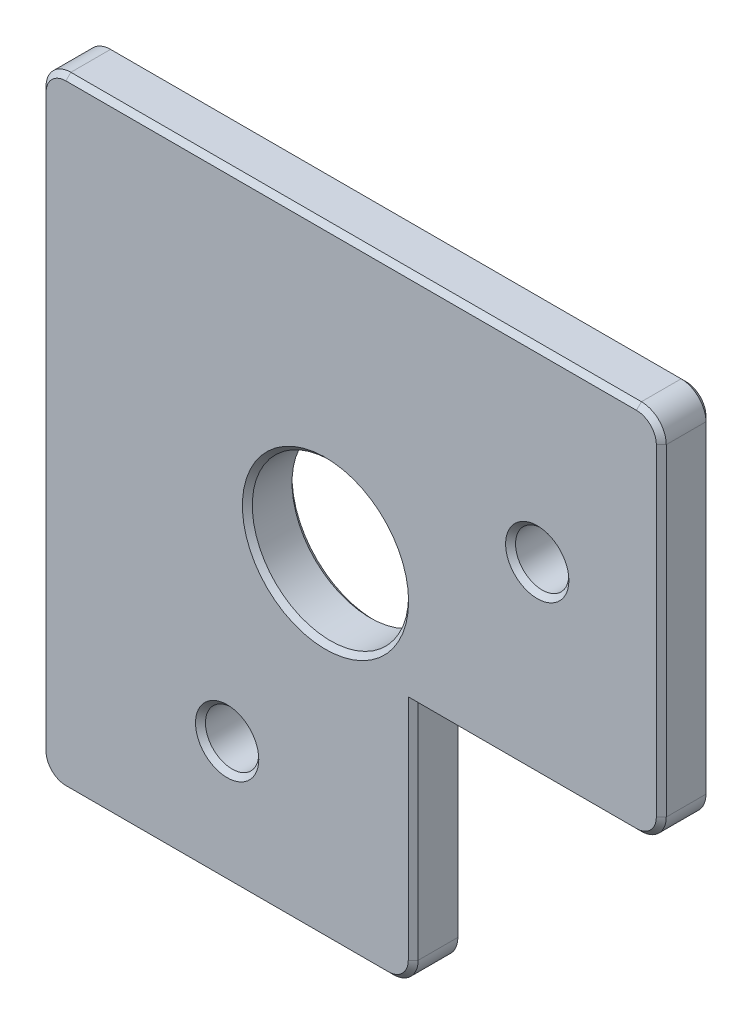
ISO-10303-21;
HEADER;
FILE_DESCRIPTION(('STEP AP214'),'2;1');
FILE_NAME('part.step','',(''),(''),'','','');
FILE_SCHEMA(('AUTOMOTIVE_DESIGN { 1 0 10303 214 1 1 1 1 }'));
ENDSEC;
DATA;
#1=APPLICATION_CONTEXT('core data for automotive mechanical design processes');
#2=APPLICATION_PROTOCOL_DEFINITION('international standard','automotive_design',2000,#1);
#3=PRODUCT_CONTEXT('',#1,'mechanical');
#4=PRODUCT('Part','Part','',(#3));
#5=PRODUCT_RELATED_PRODUCT_CATEGORY('part','',(#4));
#6=PRODUCT_DEFINITION_FORMATION('','',#4);
#7=PRODUCT_DEFINITION_CONTEXT('part definition',#1,'design');
#8=PRODUCT_DEFINITION('design','',#6,#7);
#9=PRODUCT_DEFINITION_SHAPE('','',#8);
#10=(LENGTH_UNIT() NAMED_UNIT(*) SI_UNIT(.MILLI.,.METRE.));
#11=(NAMED_UNIT(*) PLANE_ANGLE_UNIT() SI_UNIT($,.RADIAN.));
#12=(NAMED_UNIT(*) SI_UNIT($,.STERADIAN.) SOLID_ANGLE_UNIT());
#13=UNCERTAINTY_MEASURE_WITH_UNIT(LENGTH_MEASURE(1.E-05),#10,'distance_accuracy_value','');
#14=(GEOMETRIC_REPRESENTATION_CONTEXT(3) GLOBAL_UNCERTAINTY_ASSIGNED_CONTEXT((#13)) GLOBAL_UNIT_ASSIGNED_CONTEXT((#10,
#11,#12)) REPRESENTATION_CONTEXT('',''));
#15=CARTESIAN_POINT('',(0.,0.,0.));
#16=DIRECTION('',(0.,0.,1.));
#17=DIRECTION('',(1.,0.,0.));
#18=AXIS2_PLACEMENT_3D('',#15,#16,#17);
#19=CARTESIAN_POINT('',(0.,0.,4.));
#20=DIRECTION('',(0.,0.,1.));
#21=DIRECTION('',(1.,0.,0.));
#22=AXIS2_PLACEMENT_3D('',#19,#20,#21);
#23=PLANE('',#22);
#24=CARTESIAN_POINT('',(22.9289321881348,-22.9289321881346,4.));
#25=DIRECTION('',(0.,0.,1.));
#26=DIRECTION('',(1.,0.,0.));
#27=AXIS2_PLACEMENT_3D('',#24,#25,#26);
#28=CIRCLE('',#27,6.70000000000001);
#29=CARTESIAN_POINT('',(29.6289321881348,-22.9289321881346,4.));
#30=VERTEX_POINT('',#29);
#31=EDGE_CURVE('E228',#30,#30,#28,.F.);
#32=ORIENTED_EDGE('',*,*,#31,.T.);
#33=EDGE_LOOP('',(#32));
#34=FACE_BOUND('',#33,.T.);
#35=CARTESIAN_POINT('',(15.0000000000002,-40.,4.));
#36=DIRECTION('',(0.,0.,1.));
#37=DIRECTION('',(1.,0.,0.));
#38=AXIS2_PLACEMENT_3D('',#35,#36,#37);
#39=CIRCLE('',#38,2.54999999999998);
#40=CARTESIAN_POINT('',(17.5500000000002,-40.,4.));
#41=VERTEX_POINT('',#40);
#42=EDGE_CURVE('E223',#41,#41,#39,.F.);
#43=ORIENTED_EDGE('',*,*,#42,.T.);
#44=EDGE_LOOP('',(#43));
#45=FACE_BOUND('',#44,.T.);
#46=DIRECTION('',(0.,1.,0.));
#47=VECTOR('',#46,1.);
#48=CARTESIAN_POINT('',(49.6000000000003,-2.,4.));
#49=LINE('',#48,#47);
#50=CARTESIAN_POINT('',(49.6000000000003,-28.,4.));
#51=VERTEX_POINT('',#50);
#52=CARTESIAN_POINT('',(49.6000000000003,-2.,4.));
#53=VERTEX_POINT('',#52);
#54=EDGE_CURVE('E220',#51,#53,#49,.T.);
#55=ORIENTED_EDGE('',*,*,#54,.T.);
#56=CARTESIAN_POINT('',(48.0000000000003,-2.,4.));
#57=DIRECTION('',(0.,0.,1.));
#58=DIRECTION('',(1.,0.,0.));
#59=AXIS2_PLACEMENT_3D('',#56,#57,#58);
#60=CIRCLE('',#59,1.6);
#61=CARTESIAN_POINT('',(48.0000000000003,-0.399999999999998,4.));
#62=VERTEX_POINT('',#61);
#63=EDGE_CURVE('E199',#53,#62,#60,.T.);
#64=ORIENTED_EDGE('',*,*,#63,.T.);
#65=DIRECTION('',(-1.,0.,0.));
#66=VECTOR('',#65,1.);
#67=CARTESIAN_POINT('',(2.,-0.399999999999998,4.));
#68=LINE('',#67,#66);
#69=CARTESIAN_POINT('',(2.,-0.399999999999998,4.));
#70=VERTEX_POINT('',#69);
#71=EDGE_CURVE('E208',#62,#70,#68,.T.);
#72=ORIENTED_EDGE('',*,*,#71,.T.);
#73=CARTESIAN_POINT('',(2.,-2.,4.));
#74=DIRECTION('',(0.,0.,1.));
#75=DIRECTION('',(1.,0.,0.));
#76=AXIS2_PLACEMENT_3D('',#73,#74,#75);
#77=CIRCLE('',#76,1.6);
#78=CARTESIAN_POINT('',(0.399999999999998,-2.,4.));
#79=VERTEX_POINT('',#78);
#80=EDGE_CURVE('E215',#70,#79,#77,.T.);
#81=ORIENTED_EDGE('',*,*,#80,.T.);
#82=DIRECTION('',(0.,-1.,0.));
#83=VECTOR('',#82,1.);
#84=CARTESIAN_POINT('',(0.399999999999998,-48.,4.));
#85=LINE('',#84,#83);
#86=CARTESIAN_POINT('',(0.399999999999998,-48.,4.));
#87=VERTEX_POINT('',#86);
#88=EDGE_CURVE('E515',#79,#87,#85,.T.);
#89=ORIENTED_EDGE('',*,*,#88,.T.);
#90=CARTESIAN_POINT('',(2.,-48.,4.));
#91=DIRECTION('',(0.,0.,1.));
#92=DIRECTION('',(1.,0.,0.));
#93=AXIS2_PLACEMENT_3D('',#90,#91,#92);
#94=CIRCLE('',#93,1.6);
#95=CARTESIAN_POINT('',(2.,-49.6,4.));
#96=VERTEX_POINT('',#95);
#97=EDGE_CURVE('E518',#87,#96,#94,.T.);
#98=ORIENTED_EDGE('',*,*,#97,.T.);
#99=DIRECTION('',(1.,0.,0.));
#100=VECTOR('',#99,1.);
#101=CARTESIAN_POINT('',(28.0000000000003,-49.6,4.));
#102=LINE('',#101,#100);
#103=CARTESIAN_POINT('',(28.0000000000003,-49.6,4.));
#104=VERTEX_POINT('',#103);
#105=EDGE_CURVE('E521',#96,#104,#102,.T.);
#106=ORIENTED_EDGE('',*,*,#105,.T.);
#107=CARTESIAN_POINT('',(28.0000000000003,-48.,4.));
#108=DIRECTION('',(0.,0.,1.));
#109=DIRECTION('',(1.,0.,0.));
#110=AXIS2_PLACEMENT_3D('',#107,#108,#109);
#111=CIRCLE('',#110,1.6);
#112=CARTESIAN_POINT('',(29.6000000000003,-48.,4.));
#113=VERTEX_POINT('',#112);
#114=EDGE_CURVE('E524',#104,#113,#111,.T.);
#115=ORIENTED_EDGE('',*,*,#114,.T.);
#116=DIRECTION('',(0.,1.,0.));
#117=VECTOR('',#116,1.);
#118=CARTESIAN_POINT('',(29.6000000000003,-30.,4.));
#119=LINE('',#118,#117);
#120=CARTESIAN_POINT('',(29.6000000000003,-29.6,4.));
#121=VERTEX_POINT('',#120);
#122=EDGE_CURVE('E527',#113,#121,#119,.T.);
#123=ORIENTED_EDGE('',*,*,#122,.T.);
#124=DIRECTION('',(1.,0.,0.));
#125=VECTOR('',#124,1.);
#126=CARTESIAN_POINT('',(48.0000000000003,-29.6,4.));
#127=LINE('',#126,#125);
#128=CARTESIAN_POINT('',(48.0000000000003,-29.6,4.));
#129=VERTEX_POINT('',#128);
#130=EDGE_CURVE('E530',#121,#129,#127,.T.);
#131=ORIENTED_EDGE('',*,*,#130,.T.);
#132=CARTESIAN_POINT('',(48.0000000000003,-28.,4.));
#133=DIRECTION('',(0.,0.,1.));
#134=DIRECTION('',(1.,0.,0.));
#135=AXIS2_PLACEMENT_3D('',#132,#133,#134);
#136=CIRCLE('',#135,1.6);
#137=EDGE_CURVE('E230',#129,#51,#136,.T.);
#138=ORIENTED_EDGE('',*,*,#137,.T.);
#139=EDGE_LOOP('',(#55,#64,#72,#81,#89,#98,#106,#115,#123,#131,#138));
#140=FACE_BOUND('',#139,.T.);
#141=CARTESIAN_POINT('',(40.0000000000003,-15.,4.));
#142=DIRECTION('',(0.,0.,1.));
#143=DIRECTION('',(1.,0.,0.));
#144=AXIS2_PLACEMENT_3D('',#141,#142,#143);
#145=CIRCLE('',#144,2.55);
#146=CARTESIAN_POINT('',(42.5500000000003,-15.,4.));
#147=VERTEX_POINT('',#146);
#148=EDGE_CURVE('E216',#147,#147,#145,.F.);
#149=ORIENTED_EDGE('',*,*,#148,.T.);
#150=EDGE_LOOP('',(#149));
#151=FACE_BOUND('',#150,.T.);
#152=ADVANCED_FACE('F41',(#34,#45,#140,#151),#23,.T.);
#153=CARTESIAN_POINT('',(0.,0.,0.));
#154=DIRECTION('',(0.,0.,1.));
#155=DIRECTION('',(1.,0.,0.));
#156=AXIS2_PLACEMENT_3D('',#153,#154,#155);
#157=PLANE('',#156);
#158=CARTESIAN_POINT('',(22.9289321881348,-22.9289321881346,0.));
#159=DIRECTION('',(0.,0.,1.));
#160=DIRECTION('',(1.,0.,0.));
#161=AXIS2_PLACEMENT_3D('',#158,#159,#160);
#162=CIRCLE('',#161,6.70000000000001);
#163=CARTESIAN_POINT('',(29.6289321881348,-22.9289321881346,0.));
#164=VERTEX_POINT('',#163);
#165=EDGE_CURVE('E11',#164,#164,#162,.T.);
#166=ORIENTED_EDGE('',*,*,#165,.T.);
#167=EDGE_LOOP('',(#166));
#168=FACE_BOUND('',#167,.T.);
#169=CARTESIAN_POINT('',(40.0000000000003,-15.,0.));
#170=DIRECTION('',(0.,0.,1.));
#171=DIRECTION('',(1.,0.,0.));
#172=AXIS2_PLACEMENT_3D('',#169,#170,#171);
#173=CIRCLE('',#172,2.55);
#174=CARTESIAN_POINT('',(42.5500000000003,-15.,0.));
#175=VERTEX_POINT('',#174);
#176=EDGE_CURVE('E52',#175,#175,#173,.T.);
#177=ORIENTED_EDGE('',*,*,#176,.T.);
#178=EDGE_LOOP('',(#177));
#179=FACE_BOUND('',#178,.T.);
#180=CARTESIAN_POINT('',(15.0000000000002,-40.,0.));
#181=DIRECTION('',(0.,0.,1.));
#182=DIRECTION('',(1.,0.,0.));
#183=AXIS2_PLACEMENT_3D('',#180,#181,#182);
#184=CIRCLE('',#183,2.55);
#185=CARTESIAN_POINT('',(17.5500000000002,-40.,0.));
#186=VERTEX_POINT('',#185);
#187=EDGE_CURVE('E350',#186,#186,#184,.T.);
#188=ORIENTED_EDGE('',*,*,#187,.T.);
#189=EDGE_LOOP('',(#188));
#190=FACE_BOUND('',#189,.T.);
#191=DIRECTION('',(-1.,0.,0.));
#192=VECTOR('',#191,1.);
#193=CARTESIAN_POINT('',(0.,-49.6,0.));
#194=LINE('',#193,#192);
#195=CARTESIAN_POINT('',(28.0000000000003,-49.6,0.));
#196=VERTEX_POINT('',#195);
#197=CARTESIAN_POINT('',(2.,-49.6,0.));
#198=VERTEX_POINT('',#197);
#199=EDGE_CURVE('E60',#196,#198,#194,.T.);
#200=ORIENTED_EDGE('',*,*,#199,.T.);
#201=CARTESIAN_POINT('',(2.,-48.,0.));
#202=DIRECTION('',(0.,0.,1.));
#203=DIRECTION('',(1.,0.,0.));
#204=AXIS2_PLACEMENT_3D('',#201,#202,#203);
#205=CIRCLE('',#204,1.6);
#206=CARTESIAN_POINT('',(0.399999999999998,-48.,0.));
#207=VERTEX_POINT('',#206);
#208=EDGE_CURVE('E347',#198,#207,#205,.F.);
#209=ORIENTED_EDGE('',*,*,#208,.T.);
#210=DIRECTION('',(0.,1.,0.));
#211=VECTOR('',#210,1.);
#212=CARTESIAN_POINT('',(0.399999999999998,0.,0.));
#213=LINE('',#212,#211);
#214=CARTESIAN_POINT('',(0.399999999999998,-2.,0.));
#215=VERTEX_POINT('',#214);
#216=EDGE_CURVE('E319',#207,#215,#213,.T.);
#217=ORIENTED_EDGE('',*,*,#216,.T.);
#218=CARTESIAN_POINT('',(2.,-2.,0.));
#219=DIRECTION('',(0.,0.,1.));
#220=DIRECTION('',(1.,0.,0.));
#221=AXIS2_PLACEMENT_3D('',#218,#219,#220);
#222=CIRCLE('',#221,1.6);
#223=CARTESIAN_POINT('',(2.,-0.399999999999999,0.));
#224=VERTEX_POINT('',#223);
#225=EDGE_CURVE('E322',#215,#224,#222,.F.);
#226=ORIENTED_EDGE('',*,*,#225,.T.);
#227=DIRECTION('',(1.,0.,0.));
#228=VECTOR('',#227,1.);
#229=CARTESIAN_POINT('',(0.,-0.399999999999998,0.));
#230=LINE('',#229,#228);
#231=CARTESIAN_POINT('',(48.0000000000003,-0.399999999999998,0.));
#232=VERTEX_POINT('',#231);
#233=EDGE_CURVE('E325',#224,#232,#230,.T.);
#234=ORIENTED_EDGE('',*,*,#233,.T.);
#235=CARTESIAN_POINT('',(48.0000000000003,-2.,0.));
#236=DIRECTION('',(0.,0.,1.));
#237=DIRECTION('',(1.,0.,0.));
#238=AXIS2_PLACEMENT_3D('',#235,#236,#237);
#239=CIRCLE('',#238,1.6);
#240=CARTESIAN_POINT('',(49.6000000000003,-2.,0.));
#241=VERTEX_POINT('',#240);
#242=EDGE_CURVE('E328',#232,#241,#239,.F.);
#243=ORIENTED_EDGE('',*,*,#242,.T.);
#244=DIRECTION('',(0.,-1.,0.));
#245=VECTOR('',#244,1.);
#246=CARTESIAN_POINT('',(49.6000000000003,0.,0.));
#247=LINE('',#246,#245);
#248=CARTESIAN_POINT('',(49.6000000000003,-28.,0.));
#249=VERTEX_POINT('',#248);
#250=EDGE_CURVE('E331',#241,#249,#247,.T.);
#251=ORIENTED_EDGE('',*,*,#250,.T.);
#252=CARTESIAN_POINT('',(48.0000000000003,-28.,0.));
#253=DIRECTION('',(0.,0.,1.));
#254=DIRECTION('',(1.,0.,0.));
#255=AXIS2_PLACEMENT_3D('',#252,#253,#254);
#256=CIRCLE('',#255,1.6);
#257=CARTESIAN_POINT('',(48.0000000000003,-29.6,0.));
#258=VERTEX_POINT('',#257);
#259=EDGE_CURVE('E334',#249,#258,#256,.F.);
#260=ORIENTED_EDGE('',*,*,#259,.T.);
#261=DIRECTION('',(-1.,0.,0.));
#262=VECTOR('',#261,1.);
#263=CARTESIAN_POINT('',(0.,-29.6,0.));
#264=LINE('',#263,#262);
#265=CARTESIAN_POINT('',(29.6000000000003,-29.6,0.));
#266=VERTEX_POINT('',#265);
#267=EDGE_CURVE('E337',#258,#266,#264,.T.);
#268=ORIENTED_EDGE('',*,*,#267,.T.);
#269=DIRECTION('',(0.,-1.,0.));
#270=VECTOR('',#269,1.);
#271=CARTESIAN_POINT('',(29.6000000000004,0.,0.));
#272=LINE('',#271,#270);
#273=CARTESIAN_POINT('',(29.6000000000003,-48.,0.));
#274=VERTEX_POINT('',#273);
#275=EDGE_CURVE('E340',#266,#274,#272,.T.);
#276=ORIENTED_EDGE('',*,*,#275,.T.);
#277=CARTESIAN_POINT('',(28.0000000000003,-48.,0.));
#278=DIRECTION('',(0.,0.,1.));
#279=DIRECTION('',(1.,0.,0.));
#280=AXIS2_PLACEMENT_3D('',#277,#278,#279);
#281=CIRCLE('',#280,1.6);
#282=EDGE_CURVE('E65',#274,#196,#281,.F.);
#283=ORIENTED_EDGE('',*,*,#282,.T.);
#284=EDGE_LOOP('',(#200,#209,#217,#226,#234,#243,#251,#260,#268,#276,#283));
#285=FACE_BOUND('',#284,.T.);
#286=ADVANCED_FACE('F445',(#168,#179,#190,#285),#157,.F.);
#287=CARTESIAN_POINT('',(0.,-50.,4.));
#288=DIRECTION('',(1.,0.,0.));
#289=DIRECTION('',(0.,0.,-1.));
#290=AXIS2_PLACEMENT_3D('',#287,#288,#289);
#291=PLANE('',#290);
#292=DIRECTION('',(0.,0.,-1.));
#293=VECTOR('',#292,1.);
#294=CARTESIAN_POINT('',(0.,-48.,4.));
#295=LINE('',#294,#293);
#296=CARTESIAN_POINT('',(0.,-48.,0.399999999999998));
#297=VERTEX_POINT('',#296);
#298=CARTESIAN_POINT('',(0.,-48.,3.6));
#299=VERTEX_POINT('',#298);
#300=EDGE_CURVE('E592',#297,#299,#295,.F.);
#301=ORIENTED_EDGE('',*,*,#300,.T.);
#302=DIRECTION('',(0.,1.,0.));
#303=VECTOR('',#302,1.);
#304=CARTESIAN_POINT('',(0.,-2.,3.6));
#305=LINE('',#304,#303);
#306=CARTESIAN_POINT('',(0.,-2.,3.6));
#307=VERTEX_POINT('',#306);
#308=EDGE_CURVE('E296',#299,#307,#305,.T.);
#309=ORIENTED_EDGE('',*,*,#308,.T.);
#310=DIRECTION('',(0.,0.,-1.));
#311=VECTOR('',#310,1.);
#312=CARTESIAN_POINT('',(0.,-2.,4.));
#313=LINE('',#312,#311);
#314=CARTESIAN_POINT('',(0.,-2.,0.399999999999998));
#315=VERTEX_POINT('',#314);
#316=EDGE_CURVE('E479',#307,#315,#313,.T.);
#317=ORIENTED_EDGE('',*,*,#316,.T.);
#318=DIRECTION('',(0.,-1.,0.));
#319=VECTOR('',#318,1.);
#320=CARTESIAN_POINT('',(0.,-50.,0.399999999999998));
#321=LINE('',#320,#319);
#322=EDGE_CURVE('E293',#315,#297,#321,.T.);
#323=ORIENTED_EDGE('',*,*,#322,.T.);
#324=EDGE_LOOP('',(#301,#309,#317,#323));
#325=FACE_BOUND('',#324,.T.);
#326=ADVANCED_FACE('F625',(#325),#291,.F.);
#327=CARTESIAN_POINT('',(0.,-50.,4.));
#328=DIRECTION('',(0.,1.,0.));
#329=DIRECTION('',(0.,0.,1.));
#330=AXIS2_PLACEMENT_3D('',#327,#328,#329);
#331=PLANE('',#330);
#332=DIRECTION('',(0.,0.,-1.));
#333=VECTOR('',#332,1.);
#334=CARTESIAN_POINT('',(28.0000000000003,-50.,4.));
#335=LINE('',#334,#333);
#336=CARTESIAN_POINT('',(28.0000000000003,-50.,0.399999999999998));
#337=VERTEX_POINT('',#336);
#338=CARTESIAN_POINT('',(28.0000000000003,-50.,3.6));
#339=VERTEX_POINT('',#338);
#340=EDGE_CURVE('E490',#337,#339,#335,.F.);
#341=ORIENTED_EDGE('',*,*,#340,.T.);
#342=DIRECTION('',(-1.,0.,0.));
#343=VECTOR('',#342,1.);
#344=CARTESIAN_POINT('',(2.,-50.,3.6));
#345=LINE('',#344,#343);
#346=CARTESIAN_POINT('',(2.,-50.,3.6));
#347=VERTEX_POINT('',#346);
#348=EDGE_CURVE('E283',#339,#347,#345,.T.);
#349=ORIENTED_EDGE('',*,*,#348,.T.);
#350=DIRECTION('',(0.,0.,-1.));
#351=VECTOR('',#350,1.);
#352=CARTESIAN_POINT('',(2.,-50.,4.));
#353=LINE('',#352,#351);
#354=CARTESIAN_POINT('',(2.,-50.,0.399999999999998));
#355=VERTEX_POINT('',#354);
#356=EDGE_CURVE('E494',#347,#355,#353,.T.);
#357=ORIENTED_EDGE('',*,*,#356,.T.);
#358=DIRECTION('',(1.,0.,0.));
#359=VECTOR('',#358,1.);
#360=CARTESIAN_POINT('',(0.,-50.,0.399999999999998));
#361=LINE('',#360,#359);
#362=EDGE_CURVE('E280',#355,#337,#361,.T.);
#363=ORIENTED_EDGE('',*,*,#362,.T.);
#364=EDGE_LOOP('',(#341,#349,#357,#363));
#365=FACE_BOUND('',#364,.T.);
#366=ADVANCED_FACE('F586',(#365),#331,.F.);
#367=CARTESIAN_POINT('',(30.0000000000003,-50.,4.));
#368=DIRECTION('',(-1.,0.,0.));
#369=DIRECTION('',(0.,-1.,0.));
#370=AXIS2_PLACEMENT_3D('',#367,#368,#369);
#371=PLANE('',#370);
#372=DIRECTION('',(0.,0.,-1.));
#373=VECTOR('',#372,1.);
#374=CARTESIAN_POINT('',(30.0000000000003,-30.,4.));
#375=LINE('',#374,#373);
#376=CARTESIAN_POINT('',(30.0000000000003,-30.,3.6));
#377=VERTEX_POINT('',#376);
#378=CARTESIAN_POINT('',(30.0000000000003,-30.,0.399999999999998));
#379=VERTEX_POINT('',#378);
#380=EDGE_CURVE('E393',#377,#379,#375,.T.);
#381=ORIENTED_EDGE('',*,*,#380,.F.);
#382=DIRECTION('',(0.,-1.,0.));
#383=VECTOR('',#382,1.);
#384=CARTESIAN_POINT('',(30.0000000000003,-48.,3.6));
#385=LINE('',#384,#383);
#386=CARTESIAN_POINT('',(30.0000000000003,-48.,3.6));
#387=VERTEX_POINT('',#386);
#388=EDGE_CURVE('E271',#377,#387,#385,.T.);
#389=ORIENTED_EDGE('',*,*,#388,.T.);
#390=DIRECTION('',(0.,0.,-1.));
#391=VECTOR('',#390,1.);
#392=CARTESIAN_POINT('',(30.0000000000003,-48.,4.));
#393=LINE('',#392,#391);
#394=CARTESIAN_POINT('',(30.0000000000003,-48.,0.399999999999998));
#395=VERTEX_POINT('',#394);
#396=EDGE_CURVE('E498',#387,#395,#393,.T.);
#397=ORIENTED_EDGE('',*,*,#396,.T.);
#398=DIRECTION('',(0.,1.,0.));
#399=VECTOR('',#398,1.);
#400=CARTESIAN_POINT('',(30.0000000000003,-50.,0.399999999999998));
#401=LINE('',#400,#399);
#402=EDGE_CURVE('E268',#395,#379,#401,.T.);
#403=ORIENTED_EDGE('',*,*,#402,.T.);
#404=EDGE_LOOP('',(#381,#389,#397,#403));
#405=FACE_BOUND('',#404,.T.);
#406=ADVANCED_FACE('F567',(#405),#371,.F.);
#407=CARTESIAN_POINT('',(30.0000000000003,-30.,4.));
#408=DIRECTION('',(0.,1.,0.));
#409=DIRECTION('',(-1.,0.,0.));
#410=AXIS2_PLACEMENT_3D('',#407,#408,#409);
#411=PLANE('',#410);
#412=DIRECTION('',(0.,0.,-1.));
#413=VECTOR('',#412,1.);
#414=CARTESIAN_POINT('',(48.0000000000003,-30.,4.));
#415=LINE('',#414,#413);
#416=CARTESIAN_POINT('',(48.0000000000003,-30.,0.399999999999998));
#417=VERTEX_POINT('',#416);
#418=CARTESIAN_POINT('',(48.0000000000003,-30.,3.6));
#419=VERTEX_POINT('',#418);
#420=EDGE_CURVE('E486',#417,#419,#415,.F.);
#421=ORIENTED_EDGE('',*,*,#420,.T.);
#422=DIRECTION('',(-1.,0.,0.));
#423=VECTOR('',#422,1.);
#424=CARTESIAN_POINT('',(30.0000000000003,-30.,3.6));
#425=LINE('',#424,#423);
#426=EDGE_CURVE('E265',#419,#377,#425,.T.);
#427=ORIENTED_EDGE('',*,*,#426,.T.);
#428=ORIENTED_EDGE('',*,*,#380,.T.);
#429=DIRECTION('',(1.,0.,0.));
#430=VECTOR('',#429,1.);
#431=CARTESIAN_POINT('',(30.0000000000003,-30.,0.399999999999998));
#432=LINE('',#431,#430);
#433=EDGE_CURVE('E262',#379,#417,#432,.T.);
#434=ORIENTED_EDGE('',*,*,#433,.T.);
#435=EDGE_LOOP('',(#421,#427,#428,#434));
#436=FACE_BOUND('',#435,.T.);
#437=ADVANCED_FACE('F554',(#436),#411,.F.);
#438=CARTESIAN_POINT('',(50.0000000000003,-30.,4.));
#439=DIRECTION('',(-1.,0.,0.));
#440=DIRECTION('',(0.,0.,1.));
#441=AXIS2_PLACEMENT_3D('',#438,#439,#440);
#442=PLANE('',#441);
#443=DIRECTION('',(0.,0.,-1.));
#444=VECTOR('',#443,1.);
#445=CARTESIAN_POINT('',(50.0000000000003,-2.,4.));
#446=LINE('',#445,#444);
#447=CARTESIAN_POINT('',(50.0000000000003,-2.,0.399999999999998));
#448=VERTEX_POINT('',#447);
#449=CARTESIAN_POINT('',(50.0000000000003,-2.,3.6));
#450=VERTEX_POINT('',#449);
#451=EDGE_CURVE('E477',#448,#450,#446,.F.);
#452=ORIENTED_EDGE('',*,*,#451,.T.);
#453=DIRECTION('',(0.,-1.,0.));
#454=VECTOR('',#453,1.);
#455=CARTESIAN_POINT('',(50.0000000000003,-28.,3.6));
#456=LINE('',#455,#454);
#457=CARTESIAN_POINT('',(50.0000000000003,-28.,3.6));
#458=VERTEX_POINT('',#457);
#459=EDGE_CURVE('E253',#450,#458,#456,.T.);
#460=ORIENTED_EDGE('',*,*,#459,.T.);
#461=DIRECTION('',(0.,0.,-1.));
#462=VECTOR('',#461,1.);
#463=CARTESIAN_POINT('',(50.0000000000003,-28.,4.));
#464=LINE('',#463,#462);
#465=CARTESIAN_POINT('',(50.0000000000003,-28.,0.399999999999998));
#466=VERTEX_POINT('',#465);
#467=EDGE_CURVE('E472',#458,#466,#464,.T.);
#468=ORIENTED_EDGE('',*,*,#467,.T.);
#469=DIRECTION('',(0.,1.,0.));
#470=VECTOR('',#469,1.);
#471=CARTESIAN_POINT('',(50.0000000000003,-30.,0.399999999999998));
#472=LINE('',#471,#470);
#473=EDGE_CURVE('E250',#466,#448,#472,.T.);
#474=ORIENTED_EDGE('',*,*,#473,.T.);
#475=EDGE_LOOP('',(#452,#460,#468,#474));
#476=FACE_BOUND('',#475,.T.);
#477=ADVANCED_FACE('F548',(#476),#442,.F.);
#478=CARTESIAN_POINT('',(50.0000000000003,0.,4.));
#479=DIRECTION('',(0.,-1.,0.));
#480=DIRECTION('',(0.,0.,-1.));
#481=AXIS2_PLACEMENT_3D('',#478,#479,#480);
#482=PLANE('',#481);
#483=DIRECTION('',(0.,0.,-1.));
#484=VECTOR('',#483,1.);
#485=CARTESIAN_POINT('',(2.,0.,4.));
#486=LINE('',#485,#484);
#487=CARTESIAN_POINT('',(2.,0.,0.399999999999998));
#488=VERTEX_POINT('',#487);
#489=CARTESIAN_POINT('',(2.,0.,3.6));
#490=VERTEX_POINT('',#489);
#491=EDGE_CURVE('E463',#488,#490,#486,.F.);
#492=ORIENTED_EDGE('',*,*,#491,.T.);
#493=DIRECTION('',(1.,0.,0.));
#494=VECTOR('',#493,1.);
#495=CARTESIAN_POINT('',(48.0000000000003,0.,3.6));
#496=LINE('',#495,#494);
#497=CARTESIAN_POINT('',(48.0000000000003,0.,3.6));
#498=VERTEX_POINT('',#497);
#499=EDGE_CURVE('E308',#490,#498,#496,.T.);
#500=ORIENTED_EDGE('',*,*,#499,.T.);
#501=DIRECTION('',(0.,0.,-1.));
#502=VECTOR('',#501,1.);
#503=CARTESIAN_POINT('',(48.0000000000003,0.,4.));
#504=LINE('',#503,#502);
#505=CARTESIAN_POINT('',(48.0000000000003,0.,0.399999999999998));
#506=VERTEX_POINT('',#505);
#507=EDGE_CURVE('E465',#498,#506,#504,.T.);
#508=ORIENTED_EDGE('',*,*,#507,.T.);
#509=DIRECTION('',(-1.,0.,0.));
#510=VECTOR('',#509,1.);
#511=CARTESIAN_POINT('',(50.0000000000003,0.,0.399999999999998));
#512=LINE('',#511,#510);
#513=EDGE_CURVE('E305',#506,#488,#512,.T.);
#514=ORIENTED_EDGE('',*,*,#513,.T.);
#515=EDGE_LOOP('',(#492,#500,#508,#514));
#516=FACE_BOUND('',#515,.T.);
#517=ADVANCED_FACE('F462',(#516),#482,.F.);
#518=CARTESIAN_POINT('',(15.0000000000002,-40.,4.));
#519=DIRECTION('',(0.,0.,-1.));
#520=DIRECTION('',(-1.,0.,0.));
#521=AXIS2_PLACEMENT_3D('',#518,#519,#520);
#522=CYLINDRICAL_SURFACE('',#521,2.15);
#523=CARTESIAN_POINT('',(15.0000000000002,-40.,3.60000000000002));
#524=DIRECTION('',(0.,0.,1.));
#525=DIRECTION('',(1.,0.,0.));
#526=AXIS2_PLACEMENT_3D('',#523,#524,#525);
#527=CIRCLE('',#526,2.15);
#528=CARTESIAN_POINT('',(17.1500000000002,-40.,3.60000000000002));
#529=VERTEX_POINT('',#528);
#530=EDGE_CURVE('E241',#529,#529,#527,.T.);
#531=ORIENTED_EDGE('',*,*,#530,.T.);
#532=EDGE_LOOP('',(#531));
#533=FACE_BOUND('',#532,.T.);
#534=CARTESIAN_POINT('',(15.0000000000002,-40.,0.400000000000008));
#535=DIRECTION('',(0.,0.,1.));
#536=DIRECTION('',(1.,0.,0.));
#537=AXIS2_PLACEMENT_3D('',#534,#535,#536);
#538=CIRCLE('',#537,2.15);
#539=CARTESIAN_POINT('',(17.1500000000002,-40.,0.400000000000008));
#540=VERTEX_POINT('',#539);
#541=EDGE_CURVE('E237',#540,#540,#538,.F.);
#542=ORIENTED_EDGE('',*,*,#541,.T.);
#543=EDGE_LOOP('',(#542));
#544=FACE_BOUND('',#543,.T.);
#545=ADVANCED_FACE('F630',(#533,#544),#522,.F.);
#546=CARTESIAN_POINT('',(40.0000000000003,-15.,4.));
#547=DIRECTION('',(0.,0.,-1.));
#548=DIRECTION('',(-1.,0.,0.));
#549=AXIS2_PLACEMENT_3D('',#546,#547,#548);
#550=CYLINDRICAL_SURFACE('',#549,2.15);
#551=CARTESIAN_POINT('',(40.0000000000003,-15.,3.6));
#552=DIRECTION('',(0.,0.,1.));
#553=DIRECTION('',(1.,0.,0.));
#554=AXIS2_PLACEMENT_3D('',#551,#552,#553);
#555=CIRCLE('',#554,2.15);
#556=CARTESIAN_POINT('',(42.1500000000003,-15.,3.6));
#557=VERTEX_POINT('',#556);
#558=EDGE_CURVE('E315',#557,#557,#555,.T.);
#559=ORIENTED_EDGE('',*,*,#558,.T.);
#560=EDGE_LOOP('',(#559));
#561=FACE_BOUND('',#560,.T.);
#562=CARTESIAN_POINT('',(40.0000000000003,-15.,0.399999999999996));
#563=DIRECTION('',(0.,0.,1.));
#564=DIRECTION('',(1.,0.,0.));
#565=AXIS2_PLACEMENT_3D('',#562,#563,#564);
#566=CIRCLE('',#565,2.15);
#567=CARTESIAN_POINT('',(42.1500000000003,-15.,0.399999999999996));
#568=VERTEX_POINT('',#567);
#569=EDGE_CURVE('E311',#568,#568,#566,.F.);
#570=ORIENTED_EDGE('',*,*,#569,.T.);
#571=EDGE_LOOP('',(#570));
#572=FACE_BOUND('',#571,.T.);
#573=ADVANCED_FACE('F901',(#561,#572),#550,.F.);
#574=CARTESIAN_POINT('',(22.9289321881348,-22.9289321881346,4.));
#575=DIRECTION('',(0.,0.,-1.));
#576=DIRECTION('',(-1.,0.,0.));
#577=AXIS2_PLACEMENT_3D('',#574,#575,#576);
#578=CYLINDRICAL_SURFACE('',#577,6.3);
#579=CARTESIAN_POINT('',(22.9289321881348,-22.9289321881346,3.59999999999999));
#580=DIRECTION('',(0.,0.,1.));
#581=DIRECTION('',(1.,0.,0.));
#582=AXIS2_PLACEMENT_3D('',#579,#580,#581);
#583=CIRCLE('',#582,6.3);
#584=CARTESIAN_POINT('',(29.2289321881348,-22.9289321881346,3.59999999999999));
#585=VERTEX_POINT('',#584);
#586=EDGE_CURVE('E506',#585,#585,#583,.T.);
#587=ORIENTED_EDGE('',*,*,#586,.T.);
#588=EDGE_LOOP('',(#587));
#589=FACE_BOUND('',#588,.T.);
#590=CARTESIAN_POINT('',(22.9289321881348,-22.9289321881346,0.400000000000013));
#591=DIRECTION('',(0.,0.,1.));
#592=DIRECTION('',(1.,0.,0.));
#593=AXIS2_PLACEMENT_3D('',#590,#591,#592);
#594=CIRCLE('',#593,6.3);
#595=CARTESIAN_POINT('',(29.2289321881348,-22.9289321881346,0.400000000000013));
#596=VERTEX_POINT('',#595);
#597=EDGE_CURVE('E502',#596,#596,#594,.F.);
#598=ORIENTED_EDGE('',*,*,#597,.T.);
#599=EDGE_LOOP('',(#598));
#600=FACE_BOUND('',#599,.T.);
#601=ADVANCED_FACE('F648',(#589,#600),#578,.F.);
#602=CARTESIAN_POINT('',(2.,-2.,4.));
#603=DIRECTION('',(0.,0.,-1.));
#604=DIRECTION('',(-1.,0.,0.));
#605=AXIS2_PLACEMENT_3D('',#602,#603,#604);
#606=CYLINDRICAL_SURFACE('',#605,2.);
#607=ORIENTED_EDGE('',*,*,#316,.F.);
#608=CARTESIAN_POINT('',(2.,-2.,3.6));
#609=DIRECTION('',(0.,0.,1.));
#610=DIRECTION('',(1.,0.,0.));
#611=AXIS2_PLACEMENT_3D('',#608,#609,#610);
#612=CIRCLE('',#611,2.);
#613=EDGE_CURVE('E302',#307,#490,#612,.F.);
#614=ORIENTED_EDGE('',*,*,#613,.T.);
#615=ORIENTED_EDGE('',*,*,#491,.F.);
#616=CARTESIAN_POINT('',(2.,-2.,0.399999999999998));
#617=DIRECTION('',(0.,0.,1.));
#618=DIRECTION('',(1.,0.,0.));
#619=AXIS2_PLACEMENT_3D('',#616,#617,#618);
#620=CIRCLE('',#619,2.);
#621=EDGE_CURVE('E299',#488,#315,#620,.T.);
#622=ORIENTED_EDGE('',*,*,#621,.T.);
#623=EDGE_LOOP('',(#607,#614,#615,#622));
#624=FACE_BOUND('',#623,.T.);
#625=ADVANCED_FACE('F468',(#624),#606,.T.);
#626=CARTESIAN_POINT('',(48.0000000000003,-2.,4.));
#627=DIRECTION('',(0.,0.,-1.));
#628=DIRECTION('',(-1.,0.,0.));
#629=AXIS2_PLACEMENT_3D('',#626,#627,#628);
#630=CYLINDRICAL_SURFACE('',#629,2.);
#631=ORIENTED_EDGE('',*,*,#507,.F.);
#632=CARTESIAN_POINT('',(48.0000000000003,-2.,3.6));
#633=DIRECTION('',(0.,0.,1.));
#634=DIRECTION('',(1.,0.,0.));
#635=AXIS2_PLACEMENT_3D('',#632,#633,#634);
#636=CIRCLE('',#635,2.);
#637=EDGE_CURVE('E201',#498,#450,#636,.F.);
#638=ORIENTED_EDGE('',*,*,#637,.T.);
#639=ORIENTED_EDGE('',*,*,#451,.F.);
#640=CARTESIAN_POINT('',(48.0000000000003,-2.,0.399999999999998));
#641=DIRECTION('',(0.,0.,1.));
#642=DIRECTION('',(1.,0.,0.));
#643=AXIS2_PLACEMENT_3D('',#640,#641,#642);
#644=CIRCLE('',#643,2.);
#645=EDGE_CURVE('E245',#448,#506,#644,.T.);
#646=ORIENTED_EDGE('',*,*,#645,.T.);
#647=EDGE_LOOP('',(#631,#638,#639,#646));
#648=FACE_BOUND('',#647,.T.);
#649=ADVANCED_FACE('F547',(#648),#630,.T.);
#650=CARTESIAN_POINT('',(48.0000000000003,-28.,4.));
#651=DIRECTION('',(0.,0.,-1.));
#652=DIRECTION('',(-1.,0.,0.));
#653=AXIS2_PLACEMENT_3D('',#650,#651,#652);
#654=CYLINDRICAL_SURFACE('',#653,2.);
#655=ORIENTED_EDGE('',*,*,#467,.F.);
#656=CARTESIAN_POINT('',(48.0000000000003,-28.,3.6));
#657=DIRECTION('',(0.,0.,1.));
#658=DIRECTION('',(1.,0.,0.));
#659=AXIS2_PLACEMENT_3D('',#656,#657,#658);
#660=CIRCLE('',#659,2.);
#661=EDGE_CURVE('E259',#458,#419,#660,.F.);
#662=ORIENTED_EDGE('',*,*,#661,.T.);
#663=ORIENTED_EDGE('',*,*,#420,.F.);
#664=CARTESIAN_POINT('',(48.0000000000003,-28.,0.399999999999998));
#665=DIRECTION('',(0.,0.,1.));
#666=DIRECTION('',(1.,0.,0.));
#667=AXIS2_PLACEMENT_3D('',#664,#665,#666);
#668=CIRCLE('',#667,2.);
#669=EDGE_CURVE('E256',#417,#466,#668,.T.);
#670=ORIENTED_EDGE('',*,*,#669,.T.);
#671=EDGE_LOOP('',(#655,#662,#663,#670));
#672=FACE_BOUND('',#671,.T.);
#673=ADVANCED_FACE('F550',(#672),#654,.T.);
#674=CARTESIAN_POINT('',(2.,-48.,4.));
#675=DIRECTION('',(0.,0.,-1.));
#676=DIRECTION('',(-1.,0.,0.));
#677=AXIS2_PLACEMENT_3D('',#674,#675,#676);
#678=CYLINDRICAL_SURFACE('',#677,2.);
#679=ORIENTED_EDGE('',*,*,#356,.F.);
#680=CARTESIAN_POINT('',(2.,-48.,3.6));
#681=DIRECTION('',(0.,0.,1.));
#682=DIRECTION('',(1.,0.,0.));
#683=AXIS2_PLACEMENT_3D('',#680,#681,#682);
#684=CIRCLE('',#683,2.);
#685=EDGE_CURVE('E290',#347,#299,#684,.F.);
#686=ORIENTED_EDGE('',*,*,#685,.T.);
#687=ORIENTED_EDGE('',*,*,#300,.F.);
#688=CARTESIAN_POINT('',(2.,-48.,0.399999999999998));
#689=DIRECTION('',(0.,0.,1.));
#690=DIRECTION('',(1.,0.,0.));
#691=AXIS2_PLACEMENT_3D('',#688,#689,#690);
#692=CIRCLE('',#691,2.);
#693=EDGE_CURVE('E286',#297,#355,#692,.T.);
#694=ORIENTED_EDGE('',*,*,#693,.T.);
#695=EDGE_LOOP('',(#679,#686,#687,#694));
#696=FACE_BOUND('',#695,.T.);
#697=ADVANCED_FACE('F588',(#696),#678,.T.);
#698=CARTESIAN_POINT('',(28.0000000000003,-48.,4.));
#699=DIRECTION('',(0.,0.,-1.));
#700=DIRECTION('',(-1.,0.,0.));
#701=AXIS2_PLACEMENT_3D('',#698,#699,#700);
#702=CYLINDRICAL_SURFACE('',#701,2.);
#703=ORIENTED_EDGE('',*,*,#396,.F.);
#704=CARTESIAN_POINT('',(28.0000000000003,-48.,3.6));
#705=DIRECTION('',(0.,0.,1.));
#706=DIRECTION('',(1.,0.,0.));
#707=AXIS2_PLACEMENT_3D('',#704,#705,#706);
#708=CIRCLE('',#707,2.);
#709=EDGE_CURVE('E277',#387,#339,#708,.F.);
#710=ORIENTED_EDGE('',*,*,#709,.T.);
#711=ORIENTED_EDGE('',*,*,#340,.F.);
#712=CARTESIAN_POINT('',(28.0000000000003,-48.,0.399999999999998));
#713=DIRECTION('',(0.,0.,1.));
#714=DIRECTION('',(1.,0.,0.));
#715=AXIS2_PLACEMENT_3D('',#712,#713,#714);
#716=CIRCLE('',#715,2.);
#717=EDGE_CURVE('E274',#337,#395,#716,.T.);
#718=ORIENTED_EDGE('',*,*,#717,.T.);
#719=EDGE_LOOP('',(#703,#710,#711,#718));
#720=FACE_BOUND('',#719,.T.);
#721=ADVANCED_FACE('F571',(#720),#702,.T.);
#722=CARTESIAN_POINT('',(22.9289321881348,-22.9289321881346,3.59999999999999));
#723=DIRECTION('',(0.,0.,1.));
#724=DIRECTION('',(1.,0.,0.));
#725=AXIS2_PLACEMENT_3D('',#722,#723,#724);
#726=CONICAL_SURFACE('',#725,6.3,0.785398163397458);
#727=ORIENTED_EDGE('',*,*,#31,.F.);
#728=EDGE_LOOP('',(#727));
#729=FACE_BOUND('',#728,.T.);
#730=ORIENTED_EDGE('',*,*,#586,.F.);
#731=EDGE_LOOP('',(#730));
#732=FACE_BOUND('',#731,.T.);
#733=ADVANCED_FACE('F657',(#729,#732),#726,.F.);
#734=CARTESIAN_POINT('',(15.0000000000002,-40.,3.60000000000002));
#735=DIRECTION('',(0.,0.,1.));
#736=DIRECTION('',(1.,0.,0.));
#737=AXIS2_PLACEMENT_3D('',#734,#735,#736);
#738=CONICAL_SURFACE('',#737,2.15,0.785398163397451);
#739=ORIENTED_EDGE('',*,*,#42,.F.);
#740=EDGE_LOOP('',(#739));
#741=FACE_BOUND('',#740,.T.);
#742=ORIENTED_EDGE('',*,*,#530,.F.);
#743=EDGE_LOOP('',(#742));
#744=FACE_BOUND('',#743,.T.);
#745=ADVANCED_FACE('F664',(#741,#744),#738,.F.);
#746=CARTESIAN_POINT('',(28.0000000000003,-48.,4.));
#747=DIRECTION('',(0.,0.,-1.));
#748=DIRECTION('',(-1.,0.,0.));
#749=AXIS2_PLACEMENT_3D('',#746,#747,#748);
#750=CONICAL_SURFACE('',#749,1.6,0.785398163397446);
#751=DIRECTION('',(0.707106781186544,0.,-0.707106781186551));
#752=VECTOR('',#751,1.);
#753=CARTESIAN_POINT('',(29.6000000000003,-48.,4.));
#754=LINE('',#753,#752);
#755=EDGE_CURVE('E385',#113,#387,#754,.T.);
#756=ORIENTED_EDGE('',*,*,#755,.F.);
#757=ORIENTED_EDGE('',*,*,#114,.F.);
#758=DIRECTION('',(0.,0.707106781186548,0.707106781186548));
#759=VECTOR('',#758,1.);
#760=CARTESIAN_POINT('',(28.0000000000003,-50.,3.6));
#761=LINE('',#760,#759);
#762=EDGE_CURVE('E389',#339,#104,#761,.T.);
#763=ORIENTED_EDGE('',*,*,#762,.F.);
#764=ORIENTED_EDGE('',*,*,#709,.F.);
#765=EDGE_LOOP('',(#756,#757,#763,#764));
#766=FACE_BOUND('',#765,.T.);
#767=ADVANCED_FACE('F576',(#766),#750,.T.);
#768=CARTESIAN_POINT('',(0.,-49.6,4.));
#769=DIRECTION('',(0.,-0.707106781186548,0.707106781186548));
#770=DIRECTION('',(-1.,0.,0.));
#771=AXIS2_PLACEMENT_3D('',#768,#769,#770);
#772=PLANE('',#771);
#773=ORIENTED_EDGE('',*,*,#762,.T.);
#774=ORIENTED_EDGE('',*,*,#105,.F.);
#775=DIRECTION('',(0.,0.707106781186548,0.707106781186548));
#776=VECTOR('',#775,1.);
#777=CARTESIAN_POINT('',(2.,-50.,3.6));
#778=LINE('',#777,#776);
#779=EDGE_CURVE('E381',#347,#96,#778,.T.);
#780=ORIENTED_EDGE('',*,*,#779,.F.);
#781=ORIENTED_EDGE('',*,*,#348,.F.);
#782=EDGE_LOOP('',(#773,#774,#780,#781));
#783=FACE_BOUND('',#782,.T.);
#784=ADVANCED_FACE('F582',(#783),#772,.T.);
#785=CARTESIAN_POINT('',(29.6000000000004,0.,4.));
#786=DIRECTION('',(0.707106781186548,0.,0.707106781186548));
#787=DIRECTION('',(0.,-1.,0.));
#788=AXIS2_PLACEMENT_3D('',#785,#786,#787);
#789=PLANE('',#788);
#790=ORIENTED_EDGE('',*,*,#755,.T.);
#791=ORIENTED_EDGE('',*,*,#388,.F.);
#792=DIRECTION('',(-0.577350269189626,0.577350269189624,0.577350269189627));
#793=VECTOR('',#792,1.);
#794=CARTESIAN_POINT('',(19.7333333333336,-19.7333333333332,13.8666666666668));
#795=LINE('',#794,#793);
#796=EDGE_CURVE('E377',#121,#377,#795,.F.);
#797=ORIENTED_EDGE('',*,*,#796,.F.);
#798=ORIENTED_EDGE('',*,*,#122,.F.);
#799=EDGE_LOOP('',(#790,#791,#797,#798));
#800=FACE_BOUND('',#799,.T.);
#801=ADVANCED_FACE('F563',(#800),#789,.T.);
#802=CARTESIAN_POINT('',(2.,-48.,4.));
#803=DIRECTION('',(0.,0.,-1.));
#804=DIRECTION('',(-1.,0.,0.));
#805=AXIS2_PLACEMENT_3D('',#802,#803,#804);
#806=CONICAL_SURFACE('',#805,1.6,0.785398163397448);
#807=ORIENTED_EDGE('',*,*,#779,.T.);
#808=ORIENTED_EDGE('',*,*,#97,.F.);
#809=DIRECTION('',(0.707106781186546,0.,0.707106781186549));
#810=VECTOR('',#809,1.);
#811=CARTESIAN_POINT('',(0.,-48.,3.6));
#812=LINE('',#811,#810);
#813=EDGE_CURVE('E373',#299,#87,#812,.T.);
#814=ORIENTED_EDGE('',*,*,#813,.F.);
#815=ORIENTED_EDGE('',*,*,#685,.F.);
#816=EDGE_LOOP('',(#807,#808,#814,#815));
#817=FACE_BOUND('',#816,.T.);
#818=ADVANCED_FACE('F714',(#817),#806,.T.);
#819=CARTESIAN_POINT('',(0.,-29.6,4.));
#820=DIRECTION('',(0.,-0.707106781186549,0.707106781186546));
#821=DIRECTION('',(-1.,0.,0.));
#822=AXIS2_PLACEMENT_3D('',#819,#820,#821);
#823=PLANE('',#822);
#824=ORIENTED_EDGE('',*,*,#796,.T.);
#825=ORIENTED_EDGE('',*,*,#426,.F.);
#826=DIRECTION('',(0.,-0.707106781186544,-0.707106781186551));
#827=VECTOR('',#826,1.);
#828=CARTESIAN_POINT('',(48.0000000000003,-29.6,4.));
#829=LINE('',#828,#827);
#830=EDGE_CURVE('E369',#129,#419,#829,.T.);
#831=ORIENTED_EDGE('',*,*,#830,.F.);
#832=ORIENTED_EDGE('',*,*,#130,.F.);
#833=EDGE_LOOP('',(#824,#825,#831,#832));
#834=FACE_BOUND('',#833,.T.);
#835=ADVANCED_FACE('F558',(#834),#823,.T.);
#836=CARTESIAN_POINT('',(0.399999999999998,0.,4.));
#837=DIRECTION('',(-0.707106781186548,0.,0.707106781186548));
#838=DIRECTION('',(0.,1.,0.));
#839=AXIS2_PLACEMENT_3D('',#836,#837,#838);
#840=PLANE('',#839);
#841=ORIENTED_EDGE('',*,*,#813,.T.);
#842=ORIENTED_EDGE('',*,*,#88,.F.);
#843=DIRECTION('',(0.707106781186548,0.,0.707106781186548));
#844=VECTOR('',#843,1.);
#845=CARTESIAN_POINT('',(0.,-2.,3.6));
#846=LINE('',#845,#844);
#847=EDGE_CURVE('E365',#307,#79,#846,.T.);
#848=ORIENTED_EDGE('',*,*,#847,.F.);
#849=ORIENTED_EDGE('',*,*,#308,.F.);
#850=EDGE_LOOP('',(#841,#842,#848,#849));
#851=FACE_BOUND('',#850,.T.);
#852=ADVANCED_FACE('F702',(#851),#840,.T.);
#853=CARTESIAN_POINT('',(48.0000000000003,-28.,4.));
#854=DIRECTION('',(0.,0.,-1.));
#855=DIRECTION('',(-1.,0.,0.));
#856=AXIS2_PLACEMENT_3D('',#853,#854,#855);
#857=CONICAL_SURFACE('',#856,1.6,0.78539816339745);
#858=ORIENTED_EDGE('',*,*,#830,.T.);
#859=ORIENTED_EDGE('',*,*,#661,.F.);
#860=DIRECTION('',(0.707106781186548,0.,-0.707106781186548));
#861=VECTOR('',#860,1.);
#862=CARTESIAN_POINT('',(49.6000000000003,-28.,4.));
#863=LINE('',#862,#861);
#864=EDGE_CURVE('E361',#51,#458,#863,.T.);
#865=ORIENTED_EDGE('',*,*,#864,.F.);
#866=ORIENTED_EDGE('',*,*,#137,.F.);
#867=EDGE_LOOP('',(#858,#859,#865,#866));
#868=FACE_BOUND('',#867,.T.);
#869=ADVANCED_FACE('F539',(#868),#857,.T.);
#870=CARTESIAN_POINT('',(2.,-2.,4.));
#871=DIRECTION('',(0.,0.,-1.));
#872=DIRECTION('',(-1.,0.,0.));
#873=AXIS2_PLACEMENT_3D('',#870,#871,#872);
#874=CONICAL_SURFACE('',#873,1.6,0.785398163397448);
#875=ORIENTED_EDGE('',*,*,#847,.T.);
#876=ORIENTED_EDGE('',*,*,#80,.F.);
#877=DIRECTION('',(0.,-0.707106781186548,0.707106781186548));
#878=VECTOR('',#877,1.);
#879=CARTESIAN_POINT('',(2.,0.,3.6));
#880=LINE('',#879,#878);
#881=EDGE_CURVE('E211',#490,#70,#880,.T.);
#882=ORIENTED_EDGE('',*,*,#881,.F.);
#883=ORIENTED_EDGE('',*,*,#613,.F.);
#884=EDGE_LOOP('',(#875,#876,#882,#883));
#885=FACE_BOUND('',#884,.T.);
#886=ADVANCED_FACE('F690',(#885),#874,.T.);
#887=CARTESIAN_POINT('',(49.6000000000003,0.,4.));
#888=DIRECTION('',(0.707106781186548,0.,0.707106781186548));
#889=DIRECTION('',(0.,-1.,0.));
#890=AXIS2_PLACEMENT_3D('',#887,#888,#889);
#891=PLANE('',#890);
#892=ORIENTED_EDGE('',*,*,#864,.T.);
#893=ORIENTED_EDGE('',*,*,#459,.F.);
#894=DIRECTION('',(0.707106781186548,0.,-0.707106781186548));
#895=VECTOR('',#894,1.);
#896=CARTESIAN_POINT('',(49.6000000000003,-2.,4.));
#897=LINE('',#896,#895);
#898=EDGE_CURVE('E205',#53,#450,#897,.T.);
#899=ORIENTED_EDGE('',*,*,#898,.F.);
#900=ORIENTED_EDGE('',*,*,#54,.F.);
#901=EDGE_LOOP('',(#892,#893,#899,#900));
#902=FACE_BOUND('',#901,.T.);
#903=ADVANCED_FACE('F542',(#902),#891,.T.);
#904=CARTESIAN_POINT('',(0.,-0.399999999999998,4.));
#905=DIRECTION('',(0.,0.707106781186548,0.707106781186548));
#906=DIRECTION('',(1.,0.,0.));
#907=AXIS2_PLACEMENT_3D('',#904,#905,#906);
#908=PLANE('',#907);
#909=ORIENTED_EDGE('',*,*,#881,.T.);
#910=ORIENTED_EDGE('',*,*,#71,.F.);
#911=DIRECTION('',(0.,-0.707106781186548,0.707106781186548));
#912=VECTOR('',#911,1.);
#913=CARTESIAN_POINT('',(48.0000000000003,0.,3.6));
#914=LINE('',#913,#912);
#915=EDGE_CURVE('E195',#498,#62,#914,.T.);
#916=ORIENTED_EDGE('',*,*,#915,.F.);
#917=ORIENTED_EDGE('',*,*,#499,.F.);
#918=EDGE_LOOP('',(#909,#910,#916,#917));
#919=FACE_BOUND('',#918,.T.);
#920=ADVANCED_FACE('F209',(#919),#908,.T.);
#921=CARTESIAN_POINT('',(48.0000000000003,-2.,4.));
#922=DIRECTION('',(0.,0.,-1.));
#923=DIRECTION('',(-1.,0.,0.));
#924=AXIS2_PLACEMENT_3D('',#921,#922,#923);
#925=CONICAL_SURFACE('',#924,1.6,0.785398163397446);
#926=ORIENTED_EDGE('',*,*,#898,.T.);
#927=ORIENTED_EDGE('',*,*,#637,.F.);
#928=ORIENTED_EDGE('',*,*,#915,.T.);
#929=ORIENTED_EDGE('',*,*,#63,.F.);
#930=EDGE_LOOP('',(#926,#927,#928,#929));
#931=FACE_BOUND('',#930,.T.);
#932=ADVANCED_FACE('F197',(#931),#925,.T.);
#933=CARTESIAN_POINT('',(40.0000000000003,-15.,3.6));
#934=DIRECTION('',(0.,0.,1.));
#935=DIRECTION('',(1.,0.,0.));
#936=AXIS2_PLACEMENT_3D('',#933,#934,#935);
#937=CONICAL_SURFACE('',#936,2.15,0.785398163397442);
#938=ORIENTED_EDGE('',*,*,#148,.F.);
#939=EDGE_LOOP('',(#938));
#940=FACE_BOUND('',#939,.T.);
#941=ORIENTED_EDGE('',*,*,#558,.F.);
#942=EDGE_LOOP('',(#941));
#943=FACE_BOUND('',#942,.T.);
#944=ADVANCED_FACE('F679',(#940,#943),#937,.F.);
#945=CARTESIAN_POINT('',(22.9289321881348,-22.9289321881346,0.));
#946=DIRECTION('',(0.,0.,-1.));
#947=DIRECTION('',(-1.,0.,0.));
#948=AXIS2_PLACEMENT_3D('',#945,#946,#947);
#949=CONICAL_SURFACE('',#948,6.70000000000001,0.785398163397448);
#950=ORIENTED_EDGE('',*,*,#597,.F.);
#951=EDGE_LOOP('',(#950));
#952=FACE_BOUND('',#951,.T.);
#953=ORIENTED_EDGE('',*,*,#165,.F.);
#954=EDGE_LOOP('',(#953));
#955=FACE_BOUND('',#954,.T.);
#956=ADVANCED_FACE('F739',(#952,#955),#949,.F.);
#957=CARTESIAN_POINT('',(40.0000000000003,-15.,0.));
#958=DIRECTION('',(0.,0.,-1.));
#959=DIRECTION('',(-1.,0.,0.));
#960=AXIS2_PLACEMENT_3D('',#957,#958,#959);
#961=CONICAL_SURFACE('',#960,2.55,0.785398163397448);
#962=ORIENTED_EDGE('',*,*,#569,.F.);
#963=EDGE_LOOP('',(#962));
#964=FACE_BOUND('',#963,.T.);
#965=ORIENTED_EDGE('',*,*,#176,.F.);
#966=EDGE_LOOP('',(#965));
#967=FACE_BOUND('',#966,.T.);
#968=ADVANCED_FACE('F746',(#964,#967),#961,.F.);
#969=CARTESIAN_POINT('',(15.0000000000002,-40.,0.));
#970=DIRECTION('',(0.,0.,-1.));
#971=DIRECTION('',(-1.,0.,0.));
#972=AXIS2_PLACEMENT_3D('',#969,#970,#971);
#973=CONICAL_SURFACE('',#972,2.55,0.785398163397446);
#974=ORIENTED_EDGE('',*,*,#541,.F.);
#975=EDGE_LOOP('',(#974));
#976=FACE_BOUND('',#975,.T.);
#977=ORIENTED_EDGE('',*,*,#187,.F.);
#978=EDGE_LOOP('',(#977));
#979=FACE_BOUND('',#978,.T.);
#980=ADVANCED_FACE('F753',(#976,#979),#973,.F.);
#981=CARTESIAN_POINT('',(48.0000000000003,-28.,0.));
#982=DIRECTION('',(0.,0.,1.));
#983=DIRECTION('',(1.,0.,0.));
#984=AXIS2_PLACEMENT_3D('',#981,#982,#983);
#985=CONICAL_SURFACE('',#984,1.6,0.78539816339745);
#986=DIRECTION('',(0.,-0.707106781186548,0.707106781186547));
#987=VECTOR('',#986,1.);
#988=CARTESIAN_POINT('',(48.0000000000003,-29.6,0.));
#989=LINE('',#988,#987);
#990=EDGE_CURVE('E427',#258,#417,#989,.T.);
#991=ORIENTED_EDGE('',*,*,#990,.F.);
#992=ORIENTED_EDGE('',*,*,#259,.F.);
#993=DIRECTION('',(-0.707106781186548,0.,-0.707106781186547));
#994=VECTOR('',#993,1.);
#995=CARTESIAN_POINT('',(50.0000000000003,-28.,0.399999999999998));
#996=LINE('',#995,#994);
#997=EDGE_CURVE('E46',#466,#249,#996,.T.);
#998=ORIENTED_EDGE('',*,*,#997,.F.);
#999=ORIENTED_EDGE('',*,*,#669,.F.);
#1000=EDGE_LOOP('',(#991,#992,#998,#999));
#1001=FACE_BOUND('',#1000,.T.);
#1002=ADVANCED_FACE('F44',(#1001),#985,.T.);
#1003=CARTESIAN_POINT('',(50.0000000000003,-30.,0.399999999999998));
#1004=DIRECTION('',(-0.707106781186548,0.,0.707106781186548));
#1005=DIRECTION('',(0.,1.,0.));
#1006=AXIS2_PLACEMENT_3D('',#1003,#1004,#1005);
#1007=PLANE('',#1006);
#1008=ORIENTED_EDGE('',*,*,#997,.T.);
#1009=ORIENTED_EDGE('',*,*,#250,.F.);
#1010=DIRECTION('',(-0.707106781186548,0.,-0.707106781186548));
#1011=VECTOR('',#1010,1.);
#1012=CARTESIAN_POINT('',(50.0000000000003,-2.,0.399999999999998));
#1013=LINE('',#1012,#1011);
#1014=EDGE_CURVE('E424',#448,#241,#1013,.T.);
#1015=ORIENTED_EDGE('',*,*,#1014,.F.);
#1016=ORIENTED_EDGE('',*,*,#473,.F.);
#1017=EDGE_LOOP('',(#1008,#1009,#1015,#1016));
#1018=FACE_BOUND('',#1017,.T.);
#1019=ADVANCED_FACE('F440',(#1018),#1007,.F.);
#1020=CARTESIAN_POINT('',(30.0000000000003,-30.,0.399999999999998));
#1021=DIRECTION('',(0.,0.707106781186549,0.707106781186546));
#1022=DIRECTION('',(1.,0.,0.));
#1023=AXIS2_PLACEMENT_3D('',#1020,#1021,#1022);
#1024=PLANE('',#1023);
#1025=ORIENTED_EDGE('',*,*,#990,.T.);
#1026=ORIENTED_EDGE('',*,*,#433,.F.);
#1027=DIRECTION('',(-0.577350269189626,0.577350269189624,-0.577350269189627));
#1028=VECTOR('',#1027,1.);
#1029=CARTESIAN_POINT('',(36.666666666667,-36.6666666666666,7.06666666666665));
#1030=LINE('',#1029,#1028);
#1031=EDGE_CURVE('E420',#266,#379,#1030,.F.);
#1032=ORIENTED_EDGE('',*,*,#1031,.F.);
#1033=ORIENTED_EDGE('',*,*,#267,.F.);
#1034=EDGE_LOOP('',(#1025,#1026,#1032,#1033));
#1035=FACE_BOUND('',#1034,.T.);
#1036=ADVANCED_FACE('F795',(#1035),#1024,.F.);
#1037=CARTESIAN_POINT('',(48.0000000000003,-2.,0.));
#1038=DIRECTION('',(0.,0.,1.));
#1039=DIRECTION('',(1.,0.,0.));
#1040=AXIS2_PLACEMENT_3D('',#1037,#1038,#1039);
#1041=CONICAL_SURFACE('',#1040,1.6,0.785398163397446);
#1042=ORIENTED_EDGE('',*,*,#1014,.T.);
#1043=ORIENTED_EDGE('',*,*,#242,.F.);
#1044=DIRECTION('',(0.,-0.707106781186546,-0.707106781186549));
#1045=VECTOR('',#1044,1.);
#1046=CARTESIAN_POINT('',(48.0000000000003,0.,0.399999999999998));
#1047=LINE('',#1046,#1045);
#1048=EDGE_CURVE('E416',#506,#232,#1047,.T.);
#1049=ORIENTED_EDGE('',*,*,#1048,.F.);
#1050=ORIENTED_EDGE('',*,*,#645,.F.);
#1051=EDGE_LOOP('',(#1042,#1043,#1049,#1050));
#1052=FACE_BOUND('',#1051,.T.);
#1053=ADVANCED_FACE('F451',(#1052),#1041,.T.);
#1054=CARTESIAN_POINT('',(30.0000000000003,-50.,0.399999999999998));
#1055=DIRECTION('',(-0.707106781186548,0.,0.707106781186548));
#1056=DIRECTION('',(0.,1.,0.));
#1057=AXIS2_PLACEMENT_3D('',#1054,#1055,#1056);
#1058=PLANE('',#1057);
#1059=ORIENTED_EDGE('',*,*,#1031,.T.);
#1060=ORIENTED_EDGE('',*,*,#402,.F.);
#1061=DIRECTION('',(0.707106781186548,0.,0.707106781186548));
#1062=VECTOR('',#1061,1.);
#1063=CARTESIAN_POINT('',(29.6000000000003,-48.,0.));
#1064=LINE('',#1063,#1062);
#1065=EDGE_CURVE('E412',#274,#395,#1064,.T.);
#1066=ORIENTED_EDGE('',*,*,#1065,.F.);
#1067=ORIENTED_EDGE('',*,*,#275,.F.);
#1068=EDGE_LOOP('',(#1059,#1060,#1066,#1067));
#1069=FACE_BOUND('',#1068,.T.);
#1070=ADVANCED_FACE('F786',(#1069),#1058,.F.);
#1071=CARTESIAN_POINT('',(50.0000000000003,0.,0.399999999999998));
#1072=DIRECTION('',(0.,-0.707106781186548,0.707106781186548));
#1073=DIRECTION('',(-1.,0.,0.));
#1074=AXIS2_PLACEMENT_3D('',#1071,#1072,#1073);
#1075=PLANE('',#1074);
#1076=ORIENTED_EDGE('',*,*,#1048,.T.);
#1077=ORIENTED_EDGE('',*,*,#233,.F.);
#1078=DIRECTION('',(0.,-0.707106781186547,-0.707106781186547));
#1079=VECTOR('',#1078,1.);
#1080=CARTESIAN_POINT('',(2.,0.,0.399999999999998));
#1081=LINE('',#1080,#1079);
#1082=EDGE_CURVE('E408',#488,#224,#1081,.T.);
#1083=ORIENTED_EDGE('',*,*,#1082,.F.);
#1084=ORIENTED_EDGE('',*,*,#513,.F.);
#1085=EDGE_LOOP('',(#1076,#1077,#1083,#1084));
#1086=FACE_BOUND('',#1085,.T.);
#1087=ADVANCED_FACE('F455',(#1086),#1075,.F.);
#1088=CARTESIAN_POINT('',(28.0000000000003,-48.,0.));
#1089=DIRECTION('',(0.,0.,1.));
#1090=DIRECTION('',(1.,0.,0.));
#1091=AXIS2_PLACEMENT_3D('',#1088,#1089,#1090);
#1092=CONICAL_SURFACE('',#1091,1.6,0.785398163397446);
#1093=ORIENTED_EDGE('',*,*,#1065,.T.);
#1094=ORIENTED_EDGE('',*,*,#717,.F.);
#1095=DIRECTION('',(0.,-0.707106781186548,0.707106781186547));
#1096=VECTOR('',#1095,1.);
#1097=CARTESIAN_POINT('',(28.0000000000003,-49.6,0.));
#1098=LINE('',#1097,#1096);
#1099=EDGE_CURVE('E404',#196,#337,#1098,.T.);
#1100=ORIENTED_EDGE('',*,*,#1099,.F.);
#1101=ORIENTED_EDGE('',*,*,#282,.F.);
#1102=EDGE_LOOP('',(#1093,#1094,#1100,#1101));
#1103=FACE_BOUND('',#1102,.T.);
#1104=ADVANCED_FACE('F608',(#1103),#1092,.T.);
#1105=CARTESIAN_POINT('',(2.,-2.,0.));
#1106=DIRECTION('',(0.,0.,1.));
#1107=DIRECTION('',(1.,0.,0.));
#1108=AXIS2_PLACEMENT_3D('',#1105,#1106,#1107);
#1109=CONICAL_SURFACE('',#1108,1.6,0.785398163397448);
#1110=ORIENTED_EDGE('',*,*,#1082,.T.);
#1111=ORIENTED_EDGE('',*,*,#225,.F.);
#1112=DIRECTION('',(0.707106781186547,0.,-0.707106781186547));
#1113=VECTOR('',#1112,1.);
#1114=CARTESIAN_POINT('',(0.,-2.,0.399999999999998));
#1115=LINE('',#1114,#1113);
#1116=EDGE_CURVE('E400',#315,#215,#1115,.T.);
#1117=ORIENTED_EDGE('',*,*,#1116,.F.);
#1118=ORIENTED_EDGE('',*,*,#621,.F.);
#1119=EDGE_LOOP('',(#1110,#1111,#1117,#1118));
#1120=FACE_BOUND('',#1119,.T.);
#1121=ADVANCED_FACE('F605',(#1120),#1109,.T.);
#1122=CARTESIAN_POINT('',(0.,-50.,0.399999999999998));
#1123=DIRECTION('',(0.,0.707106781186548,0.707106781186548));
#1124=DIRECTION('',(1.,0.,0.));
#1125=AXIS2_PLACEMENT_3D('',#1122,#1123,#1124);
#1126=PLANE('',#1125);
#1127=ORIENTED_EDGE('',*,*,#1099,.T.);
#1128=ORIENTED_EDGE('',*,*,#362,.F.);
#1129=DIRECTION('',(0.,-0.707106781186548,0.707106781186548));
#1130=VECTOR('',#1129,1.);
#1131=CARTESIAN_POINT('',(2.,-49.6,0.));
#1132=LINE('',#1131,#1130);
#1133=EDGE_CURVE('E397',#198,#355,#1132,.T.);
#1134=ORIENTED_EDGE('',*,*,#1133,.F.);
#1135=ORIENTED_EDGE('',*,*,#199,.F.);
#1136=EDGE_LOOP('',(#1127,#1128,#1134,#1135));
#1137=FACE_BOUND('',#1136,.T.);
#1138=ADVANCED_FACE('F607',(#1137),#1126,.F.);
#1139=CARTESIAN_POINT('',(0.,-50.,0.399999999999998));
#1140=DIRECTION('',(0.707106781186548,0.,0.707106781186548));
#1141=DIRECTION('',(0.,-1.,0.));
#1142=AXIS2_PLACEMENT_3D('',#1139,#1140,#1141);
#1143=PLANE('',#1142);
#1144=ORIENTED_EDGE('',*,*,#1116,.T.);
#1145=ORIENTED_EDGE('',*,*,#216,.F.);
#1146=DIRECTION('',(0.707106781186547,0.,-0.707106781186547));
#1147=VECTOR('',#1146,1.);
#1148=CARTESIAN_POINT('',(0.,-48.,0.399999999999998));
#1149=LINE('',#1148,#1147);
#1150=EDGE_CURVE('E394',#297,#207,#1149,.T.);
#1151=ORIENTED_EDGE('',*,*,#1150,.F.);
#1152=ORIENTED_EDGE('',*,*,#322,.F.);
#1153=EDGE_LOOP('',(#1144,#1145,#1151,#1152));
#1154=FACE_BOUND('',#1153,.T.);
#1155=ADVANCED_FACE('F601',(#1154),#1143,.F.);
#1156=CARTESIAN_POINT('',(2.,-48.,0.));
#1157=DIRECTION('',(0.,0.,1.));
#1158=DIRECTION('',(1.,0.,0.));
#1159=AXIS2_PLACEMENT_3D('',#1156,#1157,#1158);
#1160=CONICAL_SURFACE('',#1159,1.6,0.785398163397448);
#1161=ORIENTED_EDGE('',*,*,#1133,.T.);
#1162=ORIENTED_EDGE('',*,*,#693,.F.);
#1163=ORIENTED_EDGE('',*,*,#1150,.T.);
#1164=ORIENTED_EDGE('',*,*,#208,.F.);
#1165=EDGE_LOOP('',(#1161,#1162,#1163,#1164));
#1166=FACE_BOUND('',#1165,.T.);
#1167=ADVANCED_FACE('F595',(#1166),#1160,.T.);
#1168=CLOSED_SHELL('',(#152,#286,#326,#366,#406,#437,#477,#517,#545,#573,#601,#625,#649,#673,
#697,#721,#733,#745,#767,#784,#801,#818,#835,#852,#869,#886,#903,#920,#932,#944,#956,#968,#980,
#1002,#1019,#1036,#1053,#1070,#1087,#1104,#1121,#1138,#1155,#1167));
#1169=MANIFOLD_SOLID_BREP('B2',#1168);
#1170=ADVANCED_BREP_SHAPE_REPRESENTATION('',(#18,#1169),#14);
#1171=SHAPE_DEFINITION_REPRESENTATION(#9,#1170);
ENDSEC;
END-ISO-10303-21;
